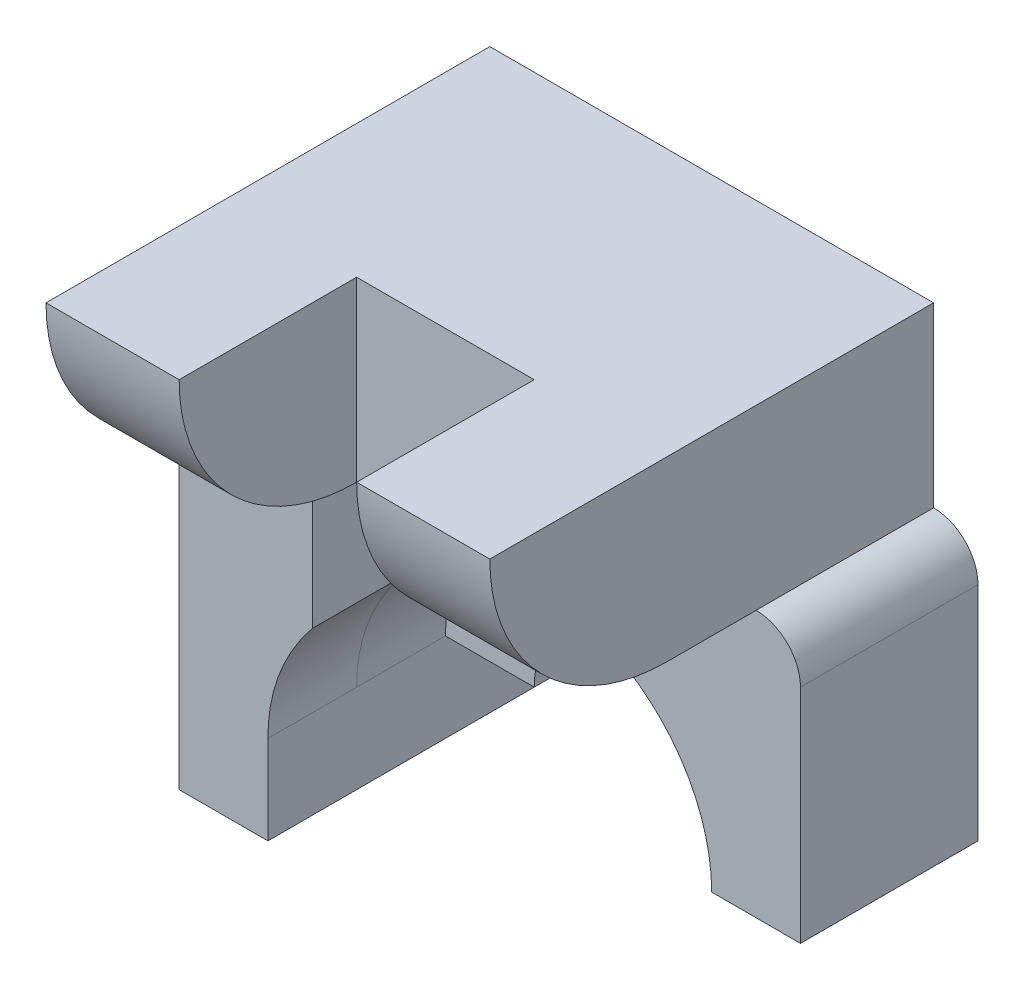
ISO-10303-21;
HEADER;
FILE_DESCRIPTION(('STEP AP214'),'2;1');
FILE_NAME('part.step','',(''),(''),'','','');
FILE_SCHEMA(('AUTOMOTIVE_DESIGN { 1 0 10303 214 1 1 1 1 }'));
ENDSEC;
DATA;
#1=APPLICATION_CONTEXT('core data for automotive mechanical design processes');
#2=APPLICATION_PROTOCOL_DEFINITION('international standard','automotive_design',2000,#1);
#3=PRODUCT_CONTEXT('',#1,'mechanical');
#4=PRODUCT('Part','Part','',(#3));
#5=PRODUCT_RELATED_PRODUCT_CATEGORY('part','',(#4));
#6=PRODUCT_DEFINITION_FORMATION('','',#4);
#7=PRODUCT_DEFINITION_CONTEXT('part definition',#1,'design');
#8=PRODUCT_DEFINITION('design','',#6,#7);
#9=PRODUCT_DEFINITION_SHAPE('','',#8);
#10=(LENGTH_UNIT() NAMED_UNIT(*) SI_UNIT(.MILLI.,.METRE.));
#11=(NAMED_UNIT(*) PLANE_ANGLE_UNIT() SI_UNIT($,.RADIAN.));
#12=(NAMED_UNIT(*) SI_UNIT($,.STERADIAN.) SOLID_ANGLE_UNIT());
#13=UNCERTAINTY_MEASURE_WITH_UNIT(LENGTH_MEASURE(1.E-05),#10,'distance_accuracy_value','');
#14=(GEOMETRIC_REPRESENTATION_CONTEXT(3) GLOBAL_UNCERTAINTY_ASSIGNED_CONTEXT((#13)) GLOBAL_UNIT_ASSIGNED_CONTEXT((#10,
#11,#12)) REPRESENTATION_CONTEXT('',''));
#15=CARTESIAN_POINT('',(0.,0.,0.));
#16=DIRECTION('',(0.,0.,1.));
#17=DIRECTION('',(1.,0.,0.));
#18=AXIS2_PLACEMENT_3D('',#15,#16,#17);
#19=CARTESIAN_POINT('',(-15.,25.,15.));
#20=DIRECTION('',(1.,0.,0.));
#21=DIRECTION('',(0.,1.,0.));
#22=AXIS2_PLACEMENT_3D('',#19,#20,#21);
#23=CYLINDRICAL_SURFACE('',#22,10.);
#24=DIRECTION('',(-1.,0.,0.));
#25=VECTOR('',#24,1.);
#26=CARTESIAN_POINT('',(12.5,25.,25.));
#27=LINE('',#26,#25);
#28=CARTESIAN_POINT('',(12.5,25.,25.));
#29=VERTEX_POINT('',#28);
#30=CARTESIAN_POINT('',(4.99999999999998,25.,25.));
#31=VERTEX_POINT('',#30);
#32=EDGE_CURVE('E202',#29,#31,#27,.T.);
#33=ORIENTED_EDGE('',*,*,#32,.T.);
#34=CARTESIAN_POINT('',(4.99999999999998,25.,15.));
#35=DIRECTION('',(1.,0.,0.));
#36=DIRECTION('',(0.,0.,-1.));
#37=AXIS2_PLACEMENT_3D('',#34,#35,#36);
#38=CIRCLE('',#37,10.);
#39=CARTESIAN_POINT('',(4.99999999999998,15.,15.));
#40=VERTEX_POINT('',#39);
#41=EDGE_CURVE('E11',#31,#40,#38,.T.);
#42=ORIENTED_EDGE('',*,*,#41,.T.);
#43=DIRECTION('',(1.,0.,0.));
#44=VECTOR('',#43,1.);
#45=CARTESIAN_POINT('',(-15.,15.,15.));
#46=LINE('',#45,#44);
#47=CARTESIAN_POINT('',(12.5,15.,15.));
#48=VERTEX_POINT('',#47);
#49=EDGE_CURVE('E194',#40,#48,#46,.T.);
#50=ORIENTED_EDGE('',*,*,#49,.T.);
#51=CARTESIAN_POINT('',(12.5,25.,15.));
#52=DIRECTION('',(-1.,0.,0.));
#53=DIRECTION('',(0.,1.,0.));
#54=AXIS2_PLACEMENT_3D('',#51,#52,#53);
#55=CIRCLE('',#54,10.);
#56=EDGE_CURVE('E191',#48,#29,#55,.T.);
#57=ORIENTED_EDGE('',*,*,#56,.T.);
#58=EDGE_LOOP('',(#33,#42,#50,#57));
#59=FACE_BOUND('',#58,.T.);
#60=ADVANCED_FACE('F35',(#59),#23,.T.);
#61=CARTESIAN_POINT('',(0.,0.,10.));
#62=DIRECTION('',(0.,0.,-1.));
#63=DIRECTION('',(-1.,0.,0.));
#64=AXIS2_PLACEMENT_3D('',#61,#62,#63);
#65=PLANE('',#64);
#66=DIRECTION('',(0.,1.,0.));
#67=VECTOR('',#66,1.);
#68=CARTESIAN_POINT('',(-7.5,15.,10.));
#69=LINE('',#68,#67);
#70=CARTESIAN_POINT('',(-7.5,6.61437827766148,10.));
#71=VERTEX_POINT('',#70);
#72=CARTESIAN_POINT('',(-7.5,15.,10.));
#73=VERTEX_POINT('',#72);
#74=EDGE_CURVE('E58',#71,#73,#69,.T.);
#75=ORIENTED_EDGE('',*,*,#74,.F.);
#76=CARTESIAN_POINT('',(0.,0.,10.));
#77=DIRECTION('',(0.,0.,-1.));
#78=DIRECTION('',(-1.,0.,0.));
#79=AXIS2_PLACEMENT_3D('',#76,#77,#78);
#80=CIRCLE('',#79,10.);
#81=CARTESIAN_POINT('',(10.,0.,10.));
#82=VERTEX_POINT('',#81);
#83=EDGE_CURVE('E380',#71,#82,#80,.T.);
#84=ORIENTED_EDGE('',*,*,#83,.T.);
#85=DIRECTION('',(1.,0.,0.));
#86=VECTOR('',#85,1.);
#87=CARTESIAN_POINT('',(10.,0.,10.));
#88=LINE('',#87,#86);
#89=CARTESIAN_POINT('',(15.,0.,10.));
#90=VERTEX_POINT('',#89);
#91=EDGE_CURVE('E411',#82,#90,#88,.T.);
#92=ORIENTED_EDGE('',*,*,#91,.T.);
#93=DIRECTION('',(0.,1.,0.));
#94=VECTOR('',#93,1.);
#95=CARTESIAN_POINT('',(15.,0.,10.));
#96=LINE('',#95,#94);
#97=CARTESIAN_POINT('',(15.,12.5,10.));
#98=VERTEX_POINT('',#97);
#99=EDGE_CURVE('E410',#90,#98,#96,.T.);
#100=ORIENTED_EDGE('',*,*,#99,.T.);
#101=CARTESIAN_POINT('',(12.5,12.5,10.));
#102=DIRECTION('',(0.,0.,1.));
#103=DIRECTION('',(1.,0.,0.));
#104=AXIS2_PLACEMENT_3D('',#101,#102,#103);
#105=CIRCLE('',#104,2.5);
#106=CARTESIAN_POINT('',(12.5,15.,10.));
#107=VERTEX_POINT('',#106);
#108=EDGE_CURVE('E359',#98,#107,#105,.T.);
#109=ORIENTED_EDGE('',*,*,#108,.T.);
#110=DIRECTION('',(-1.,0.,0.));
#111=VECTOR('',#110,1.);
#112=CARTESIAN_POINT('',(12.5,15.,10.));
#113=LINE('',#112,#111);
#114=EDGE_CURVE('E356',#107,#73,#113,.T.);
#115=ORIENTED_EDGE('',*,*,#114,.T.);
#116=EDGE_LOOP('',(#75,#84,#92,#100,#109,#115));
#117=FACE_BOUND('',#116,.T.);
#118=ADVANCED_FACE('F256',(#117),#65,.F.);
#119=CARTESIAN_POINT('',(0.,0.,10.));
#120=DIRECTION('',(0.,0.,-1.));
#121=DIRECTION('',(-1.,0.,0.));
#122=AXIS2_PLACEMENT_3D('',#119,#120,#121);
#123=CYLINDRICAL_SURFACE('',#122,10.);
#124=DIRECTION('',(0.,0.,-1.));
#125=VECTOR('',#124,1.);
#126=CARTESIAN_POINT('',(-10.,0.,10.));
#127=LINE('',#126,#125);
#128=CARTESIAN_POINT('',(-10.,0.,10.));
#129=VERTEX_POINT('',#128);
#130=CARTESIAN_POINT('',(-10.,0.,5.));
#131=VERTEX_POINT('',#130);
#132=EDGE_CURVE('E358',#129,#131,#127,.T.);
#133=ORIENTED_EDGE('',*,*,#132,.T.);
#134=CARTESIAN_POINT('',(0.,0.,5.));
#135=DIRECTION('',(0.,0.,1.));
#136=DIRECTION('',(1.,0.,0.));
#137=AXIS2_PLACEMENT_3D('',#134,#135,#136);
#138=CIRCLE('',#137,10.);
#139=CARTESIAN_POINT('',(10.,0.,5.));
#140=VERTEX_POINT('',#139);
#141=EDGE_CURVE('E428',#131,#140,#138,.F.);
#142=ORIENTED_EDGE('',*,*,#141,.T.);
#143=DIRECTION('',(0.,0.,-1.));
#144=VECTOR('',#143,1.);
#145=CARTESIAN_POINT('',(10.,0.,10.));
#146=LINE('',#145,#144);
#147=EDGE_CURVE('E344',#82,#140,#146,.T.);
#148=ORIENTED_EDGE('',*,*,#147,.F.);
#149=ORIENTED_EDGE('',*,*,#83,.F.);
#150=EDGE_CURVE('E412',#129,#71,#80,.T.);
#151=ORIENTED_EDGE('',*,*,#150,.F.);
#152=EDGE_LOOP('',(#133,#142,#148,#149,#151));
#153=FACE_BOUND('',#152,.T.);
#154=ADVANCED_FACE('F37',(#153),#123,.F.);
#155=CARTESIAN_POINT('',(10.,0.,10.));
#156=DIRECTION('',(0.,1.,0.));
#157=DIRECTION('',(0.,0.,1.));
#158=AXIS2_PLACEMENT_3D('',#155,#156,#157);
#159=PLANE('',#158);
#160=DIRECTION('',(1.,0.,0.));
#161=VECTOR('',#160,1.);
#162=CARTESIAN_POINT('',(10.,0.,0.));
#163=LINE('',#162,#161);
#164=CARTESIAN_POINT('',(5.,0.,0.));
#165=VERTEX_POINT('',#164);
#166=CARTESIAN_POINT('',(15.,0.,0.));
#167=VERTEX_POINT('',#166);
#168=EDGE_CURVE('E364',#165,#167,#163,.T.);
#169=ORIENTED_EDGE('',*,*,#168,.T.);
#170=DIRECTION('',(0.,0.,-1.));
#171=VECTOR('',#170,1.);
#172=CARTESIAN_POINT('',(15.,0.,10.));
#173=LINE('',#172,#171);
#174=EDGE_CURVE('E346',#90,#167,#173,.T.);
#175=ORIENTED_EDGE('',*,*,#174,.F.);
#176=ORIENTED_EDGE('',*,*,#91,.F.);
#177=ORIENTED_EDGE('',*,*,#147,.T.);
#178=DIRECTION('',(1.,0.,0.));
#179=VECTOR('',#178,1.);
#180=CARTESIAN_POINT('',(0.,0.,5.));
#181=LINE('',#180,#179);
#182=CARTESIAN_POINT('',(5.,0.,5.));
#183=VERTEX_POINT('',#182);
#184=EDGE_CURVE('E424',#183,#140,#181,.T.);
#185=ORIENTED_EDGE('',*,*,#184,.F.);
#186=DIRECTION('',(0.,0.,-1.));
#187=VECTOR('',#186,1.);
#188=CARTESIAN_POINT('',(5.,0.,5.));
#189=LINE('',#188,#187);
#190=EDGE_CURVE('E421',#183,#165,#189,.T.);
#191=ORIENTED_EDGE('',*,*,#190,.T.);
#192=EDGE_LOOP('',(#169,#175,#176,#177,#185,#191));
#193=FACE_BOUND('',#192,.T.);
#194=ADVANCED_FACE('F284',(#193),#159,.F.);
#195=CARTESIAN_POINT('',(15.,0.,10.));
#196=DIRECTION('',(-1.,0.,0.));
#197=DIRECTION('',(0.,0.,1.));
#198=AXIS2_PLACEMENT_3D('',#195,#196,#197);
#199=PLANE('',#198);
#200=DIRECTION('',(0.,1.,0.));
#201=VECTOR('',#200,1.);
#202=CARTESIAN_POINT('',(15.,0.,0.));
#203=LINE('',#202,#201);
#204=CARTESIAN_POINT('',(15.,12.5,0.));
#205=VERTEX_POINT('',#204);
#206=EDGE_CURVE('E366',#167,#205,#203,.T.);
#207=ORIENTED_EDGE('',*,*,#206,.T.);
#208=DIRECTION('',(0.,0.,-1.));
#209=VECTOR('',#208,1.);
#210=CARTESIAN_POINT('',(15.,12.5,10.));
#211=LINE('',#210,#209);
#212=EDGE_CURVE('E353',#98,#205,#211,.T.);
#213=ORIENTED_EDGE('',*,*,#212,.F.);
#214=ORIENTED_EDGE('',*,*,#99,.F.);
#215=ORIENTED_EDGE('',*,*,#174,.T.);
#216=EDGE_LOOP('',(#207,#213,#214,#215));
#217=FACE_BOUND('',#216,.T.);
#218=ADVANCED_FACE('F281',(#217),#199,.F.);
#219=CARTESIAN_POINT('',(12.5,12.5,10.));
#220=DIRECTION('',(0.,0.,-1.));
#221=DIRECTION('',(-1.,0.,0.));
#222=AXIS2_PLACEMENT_3D('',#219,#220,#221);
#223=CYLINDRICAL_SURFACE('',#222,2.5);
#224=CARTESIAN_POINT('',(12.5,12.5,0.));
#225=DIRECTION('',(0.,0.,1.));
#226=DIRECTION('',(1.,0.,0.));
#227=AXIS2_PLACEMENT_3D('',#224,#225,#226);
#228=CIRCLE('',#227,2.5);
#229=CARTESIAN_POINT('',(12.5,15.,0.));
#230=VERTEX_POINT('',#229);
#231=EDGE_CURVE('E369',#205,#230,#228,.T.);
#232=ORIENTED_EDGE('',*,*,#231,.T.);
#233=DIRECTION('',(0.,0.,-1.));
#234=VECTOR('',#233,1.);
#235=CARTESIAN_POINT('',(12.5,15.,10.));
#236=LINE('',#235,#234);
#237=EDGE_CURVE('E395',#107,#230,#236,.T.);
#238=ORIENTED_EDGE('',*,*,#237,.F.);
#239=ORIENTED_EDGE('',*,*,#108,.F.);
#240=ORIENTED_EDGE('',*,*,#212,.T.);
#241=EDGE_LOOP('',(#232,#238,#239,#240));
#242=FACE_BOUND('',#241,.T.);
#243=ADVANCED_FACE('F277',(#242),#223,.T.);
#244=CARTESIAN_POINT('',(-12.5,12.5,10.));
#245=DIRECTION('',(0.,0.,-1.));
#246=DIRECTION('',(-1.,0.,0.));
#247=AXIS2_PLACEMENT_3D('',#244,#245,#246);
#248=CYLINDRICAL_SURFACE('',#247,2.5);
#249=CARTESIAN_POINT('',(-12.5,12.5,0.));
#250=DIRECTION('',(0.,0.,1.));
#251=DIRECTION('',(-1.,0.,0.));
#252=AXIS2_PLACEMENT_3D('',#249,#250,#251);
#253=CIRCLE('',#252,2.5);
#254=CARTESIAN_POINT('',(-12.5,15.,0.));
#255=VERTEX_POINT('',#254);
#256=CARTESIAN_POINT('',(-15.,12.5,0.));
#257=VERTEX_POINT('',#256);
#258=EDGE_CURVE('E372',#255,#257,#253,.T.);
#259=ORIENTED_EDGE('',*,*,#258,.T.);
#260=DIRECTION('',(0.,0.,-1.));
#261=VECTOR('',#260,1.);
#262=CARTESIAN_POINT('',(-15.,12.5,10.));
#263=LINE('',#262,#261);
#264=CARTESIAN_POINT('',(-15.,12.5,15.));
#265=VERTEX_POINT('',#264);
#266=EDGE_CURVE('E389',#265,#257,#263,.T.);
#267=ORIENTED_EDGE('',*,*,#266,.F.);
#268=CARTESIAN_POINT('',(-12.5,12.5,15.));
#269=DIRECTION('',(0.,0.,1.));
#270=DIRECTION('',(1.,0.,0.));
#271=AXIS2_PLACEMENT_3D('',#268,#269,#270);
#272=CIRCLE('',#271,2.5);
#273=CARTESIAN_POINT('',(-12.5,15.,15.));
#274=VERTEX_POINT('',#273);
#275=EDGE_CURVE('E337',#274,#265,#272,.T.);
#276=ORIENTED_EDGE('',*,*,#275,.F.);
#277=DIRECTION('',(0.,0.,-1.));
#278=VECTOR('',#277,1.);
#279=CARTESIAN_POINT('',(-12.5,15.,10.));
#280=LINE('',#279,#278);
#281=EDGE_CURVE('E392',#274,#255,#280,.T.);
#282=ORIENTED_EDGE('',*,*,#281,.T.);
#283=EDGE_LOOP('',(#259,#267,#276,#282));
#284=FACE_BOUND('',#283,.T.);
#285=ADVANCED_FACE('F273',(#284),#248,.T.);
#286=CARTESIAN_POINT('',(-15.,12.5,10.));
#287=DIRECTION('',(1.,0.,0.));
#288=DIRECTION('',(0.,1.,0.));
#289=AXIS2_PLACEMENT_3D('',#286,#287,#288);
#290=PLANE('',#289);
#291=DIRECTION('',(0.,-1.,0.));
#292=VECTOR('',#291,1.);
#293=CARTESIAN_POINT('',(-15.,12.5,0.));
#294=LINE('',#293,#292);
#295=CARTESIAN_POINT('',(-15.,-5.,0.));
#296=VERTEX_POINT('',#295);
#297=EDGE_CURVE('E374',#257,#296,#294,.T.);
#298=ORIENTED_EDGE('',*,*,#297,.T.);
#299=DIRECTION('',(0.,0.,-1.));
#300=VECTOR('',#299,1.);
#301=CARTESIAN_POINT('',(-15.,-5.,10.));
#302=LINE('',#301,#300);
#303=CARTESIAN_POINT('',(-15.,-5.,15.));
#304=VERTEX_POINT('',#303);
#305=EDGE_CURVE('E386',#304,#296,#302,.T.);
#306=ORIENTED_EDGE('',*,*,#305,.F.);
#307=DIRECTION('',(0.,-1.,0.));
#308=VECTOR('',#307,1.);
#309=CARTESIAN_POINT('',(-15.,12.5,15.));
#310=LINE('',#309,#308);
#311=EDGE_CURVE('E332',#265,#304,#310,.T.);
#312=ORIENTED_EDGE('',*,*,#311,.F.);
#313=ORIENTED_EDGE('',*,*,#266,.T.);
#314=EDGE_LOOP('',(#298,#306,#312,#313));
#315=FACE_BOUND('',#314,.T.);
#316=ADVANCED_FACE('F269',(#315),#290,.F.);
#317=CARTESIAN_POINT('',(-15.,-5.,10.));
#318=DIRECTION('',(0.,1.,0.));
#319=DIRECTION('',(0.,0.,1.));
#320=AXIS2_PLACEMENT_3D('',#317,#318,#319);
#321=PLANE('',#320);
#322=DIRECTION('',(1.,0.,0.));
#323=VECTOR('',#322,1.);
#324=CARTESIAN_POINT('',(-15.,-5.,0.));
#325=LINE('',#324,#323);
#326=CARTESIAN_POINT('',(-10.,-5.,0.));
#327=VERTEX_POINT('',#326);
#328=EDGE_CURVE('E376',#296,#327,#325,.T.);
#329=ORIENTED_EDGE('',*,*,#328,.T.);
#330=DIRECTION('',(0.,0.,-1.));
#331=VECTOR('',#330,1.);
#332=CARTESIAN_POINT('',(-10.,-5.,10.));
#333=LINE('',#332,#331);
#334=CARTESIAN_POINT('',(-10.,-5.,15.));
#335=VERTEX_POINT('',#334);
#336=EDGE_CURVE('E383',#335,#327,#333,.T.);
#337=ORIENTED_EDGE('',*,*,#336,.F.);
#338=DIRECTION('',(1.,0.,0.));
#339=VECTOR('',#338,1.);
#340=CARTESIAN_POINT('',(-15.,-5.,15.));
#341=LINE('',#340,#339);
#342=EDGE_CURVE('E220',#304,#335,#341,.T.);
#343=ORIENTED_EDGE('',*,*,#342,.F.);
#344=ORIENTED_EDGE('',*,*,#305,.T.);
#345=EDGE_LOOP('',(#329,#337,#343,#344));
#346=FACE_BOUND('',#345,.T.);
#347=ADVANCED_FACE('F265',(#346),#321,.F.);
#348=CARTESIAN_POINT('',(-10.,-5.,10.));
#349=DIRECTION('',(-1.,0.,0.));
#350=DIRECTION('',(0.,0.,1.));
#351=AXIS2_PLACEMENT_3D('',#348,#349,#350);
#352=PLANE('',#351);
#353=DIRECTION('',(0.,1.,0.));
#354=VECTOR('',#353,1.);
#355=CARTESIAN_POINT('',(-10.,-5.,0.));
#356=LINE('',#355,#354);
#357=CARTESIAN_POINT('',(-10.,0.,0.));
#358=VERTEX_POINT('',#357);
#359=EDGE_CURVE('E378',#327,#358,#356,.T.);
#360=ORIENTED_EDGE('',*,*,#359,.T.);
#361=DIRECTION('',(0.,0.,-1.));
#362=VECTOR('',#361,1.);
#363=CARTESIAN_POINT('',(-10.,0.,5.));
#364=LINE('',#363,#362);
#365=EDGE_CURVE('E367',#131,#358,#364,.T.);
#366=ORIENTED_EDGE('',*,*,#365,.F.);
#367=ORIENTED_EDGE('',*,*,#132,.F.);
#368=DIRECTION('',(0.,0.,-1.));
#369=VECTOR('',#368,1.);
#370=CARTESIAN_POINT('',(-10.,0.,15.));
#371=LINE('',#370,#369);
#372=CARTESIAN_POINT('',(-10.,0.,15.));
#373=VERTEX_POINT('',#372);
#374=EDGE_CURVE('E334',#373,#129,#371,.T.);
#375=ORIENTED_EDGE('',*,*,#374,.F.);
#376=DIRECTION('',(0.,1.,0.));
#377=VECTOR('',#376,1.);
#378=CARTESIAN_POINT('',(-10.,-5.,15.));
#379=LINE('',#378,#377);
#380=EDGE_CURVE('E223',#335,#373,#379,.T.);
#381=ORIENTED_EDGE('',*,*,#380,.F.);
#382=ORIENTED_EDGE('',*,*,#336,.T.);
#383=EDGE_LOOP('',(#360,#366,#367,#375,#381,#382));
#384=FACE_BOUND('',#383,.T.);
#385=ADVANCED_FACE('F261',(#384),#352,.F.);
#386=CARTESIAN_POINT('',(0.,0.,0.));
#387=DIRECTION('',(0.,0.,-1.));
#388=DIRECTION('',(-1.,0.,0.));
#389=AXIS2_PLACEMENT_3D('',#386,#387,#388);
#390=PLANE('',#389);
#391=ORIENTED_EDGE('',*,*,#168,.F.);
#392=CARTESIAN_POINT('',(0.,0.,0.));
#393=DIRECTION('',(0.,0.,1.));
#394=DIRECTION('',(1.,0.,0.));
#395=AXIS2_PLACEMENT_3D('',#392,#393,#394);
#396=CIRCLE('',#395,5.);
#397=CARTESIAN_POINT('',(-5.,0.,0.));
#398=VERTEX_POINT('',#397);
#399=EDGE_CURVE('E425',#165,#398,#396,.T.);
#400=ORIENTED_EDGE('',*,*,#399,.T.);
#401=DIRECTION('',(-1.,0.,0.));
#402=VECTOR('',#401,1.);
#403=CARTESIAN_POINT('',(0.,0.,0.));
#404=LINE('',#403,#402);
#405=EDGE_CURVE('E429',#398,#358,#404,.T.);
#406=ORIENTED_EDGE('',*,*,#405,.T.);
#407=ORIENTED_EDGE('',*,*,#359,.F.);
#408=ORIENTED_EDGE('',*,*,#328,.F.);
#409=ORIENTED_EDGE('',*,*,#297,.F.);
#410=ORIENTED_EDGE('',*,*,#258,.F.);
#411=DIRECTION('',(0.,-1.,0.));
#412=VECTOR('',#411,1.);
#413=CARTESIAN_POINT('',(-12.5,15.,0.));
#414=LINE('',#413,#412);
#415=CARTESIAN_POINT('',(-12.5,25.,0.));
#416=VERTEX_POINT('',#415);
#417=EDGE_CURVE('E210',#416,#255,#414,.T.);
#418=ORIENTED_EDGE('',*,*,#417,.F.);
#419=DIRECTION('',(-1.,0.,0.));
#420=VECTOR('',#419,1.);
#421=CARTESIAN_POINT('',(12.5,25.,0.));
#422=LINE('',#421,#420);
#423=CARTESIAN_POINT('',(12.5,25.,0.));
#424=VERTEX_POINT('',#423);
#425=EDGE_CURVE('E208',#424,#416,#422,.T.);
#426=ORIENTED_EDGE('',*,*,#425,.F.);
#427=DIRECTION('',(0.,1.,0.));
#428=VECTOR('',#427,1.);
#429=CARTESIAN_POINT('',(12.5,15.,0.));
#430=LINE('',#429,#428);
#431=EDGE_CURVE('E201',#230,#424,#430,.T.);
#432=ORIENTED_EDGE('',*,*,#431,.F.);
#433=ORIENTED_EDGE('',*,*,#231,.F.);
#434=ORIENTED_EDGE('',*,*,#206,.F.);
#435=EDGE_LOOP('',(#391,#400,#406,#407,#408,#409,#410,#418,#426,#432,#433,#434));
#436=FACE_BOUND('',#435,.T.);
#437=ADVANCED_FACE('F254',(#436),#390,.T.);
#438=CARTESIAN_POINT('',(0.,0.,5.));
#439=DIRECTION('',(0.,-1.,0.));
#440=DIRECTION('',(1.,0.,0.));
#441=AXIS2_PLACEMENT_3D('',#438,#439,#440);
#442=PLANE('',#441);
#443=ORIENTED_EDGE('',*,*,#405,.F.);
#444=DIRECTION('',(0.,0.,-1.));
#445=VECTOR('',#444,1.);
#446=CARTESIAN_POINT('',(-5.,0.,5.));
#447=LINE('',#446,#445);
#448=CARTESIAN_POINT('',(-5.,0.,5.));
#449=VERTEX_POINT('',#448);
#450=EDGE_CURVE('E419',#449,#398,#447,.T.);
#451=ORIENTED_EDGE('',*,*,#450,.F.);
#452=DIRECTION('',(-1.,0.,0.));
#453=VECTOR('',#452,1.);
#454=CARTESIAN_POINT('',(0.,0.,5.));
#455=LINE('',#454,#453);
#456=EDGE_CURVE('E436',#449,#131,#455,.T.);
#457=ORIENTED_EDGE('',*,*,#456,.T.);
#458=ORIENTED_EDGE('',*,*,#365,.T.);
#459=EDGE_LOOP('',(#443,#451,#457,#458));
#460=FACE_BOUND('',#459,.T.);
#461=ADVANCED_FACE('F250',(#460),#442,.T.);
#462=CARTESIAN_POINT('',(0.,0.,5.));
#463=DIRECTION('',(0.,0.,-1.));
#464=DIRECTION('',(-1.,0.,0.));
#465=AXIS2_PLACEMENT_3D('',#462,#463,#464);
#466=CYLINDRICAL_SURFACE('',#465,5.);
#467=ORIENTED_EDGE('',*,*,#399,.F.);
#468=ORIENTED_EDGE('',*,*,#190,.F.);
#469=CARTESIAN_POINT('',(0.,0.,5.));
#470=DIRECTION('',(0.,0.,1.));
#471=DIRECTION('',(1.,0.,0.));
#472=AXIS2_PLACEMENT_3D('',#469,#470,#471);
#473=CIRCLE('',#472,5.);
#474=EDGE_CURVE('E433',#183,#449,#473,.T.);
#475=ORIENTED_EDGE('',*,*,#474,.T.);
#476=ORIENTED_EDGE('',*,*,#450,.T.);
#477=EDGE_LOOP('',(#467,#468,#475,#476));
#478=FACE_BOUND('',#477,.T.);
#479=ADVANCED_FACE('F246',(#478),#466,.F.);
#480=CARTESIAN_POINT('',(0.,0.,5.));
#481=DIRECTION('',(0.,0.,1.));
#482=DIRECTION('',(1.,0.,0.));
#483=AXIS2_PLACEMENT_3D('',#480,#481,#482);
#484=PLANE('',#483);
#485=ORIENTED_EDGE('',*,*,#141,.F.);
#486=ORIENTED_EDGE('',*,*,#456,.F.);
#487=ORIENTED_EDGE('',*,*,#474,.F.);
#488=ORIENTED_EDGE('',*,*,#184,.T.);
#489=EDGE_LOOP('',(#485,#486,#487,#488));
#490=FACE_BOUND('',#489,.T.);
#491=ADVANCED_FACE('F241',(#490),#484,.T.);
#492=CARTESIAN_POINT('',(-10.,0.,15.));
#493=CARTESIAN_POINT('',(-10.,3.53553390593274,15.));
#494=CARTESIAN_POINT('',(-7.5,6.61437827766148,15.));
#495=B_SPLINE_CURVE_WITH_KNOTS('',2,(#492,#493,#494),.UNSPECIFIED.,.F.,.F.,(3,3),(0.,1.),.UNSPECIFIED.);
#496=DIRECTION('',(0.,0.,-1.));
#497=VECTOR('',#496,1.);
#498=SURFACE_OF_LINEAR_EXTRUSION('',#495,#497);
#499=CARTESIAN_POINT('',(-10.,0.,10.));
#500=CARTESIAN_POINT('',(-10.,3.53553390593274,10.));
#501=CARTESIAN_POINT('',(-7.5,6.61437827766148,10.));
#502=B_SPLINE_CURVE_WITH_KNOTS('',2,(#499,#500,#501),.UNSPECIFIED.,.F.,.F.,(3,3),(0.,1.),.UNSPECIFIED.);
#503=EDGE_CURVE('E219',#129,#71,#502,.T.);
#504=ORIENTED_EDGE('',*,*,#503,.T.);
#505=DIRECTION('',(0.,0.,-1.));
#506=VECTOR('',#505,1.);
#507=CARTESIAN_POINT('',(-7.5,6.61437827766148,15.));
#508=LINE('',#507,#506);
#509=CARTESIAN_POINT('',(-7.5,6.61437827766148,15.));
#510=VERTEX_POINT('',#509);
#511=EDGE_CURVE('E331',#510,#71,#508,.T.);
#512=ORIENTED_EDGE('',*,*,#511,.F.);
#513=EDGE_CURVE('E225',#373,#510,#495,.T.);
#514=ORIENTED_EDGE('',*,*,#513,.F.);
#515=ORIENTED_EDGE('',*,*,#374,.T.);
#516=EDGE_LOOP('',(#504,#512,#514,#515));
#517=FACE_BOUND('',#516,.T.);
#518=ADVANCED_FACE('F236',(#517),#498,.F.);
#519=CARTESIAN_POINT('',(-7.5,15.,15.));
#520=DIRECTION('',(-1.,0.,0.));
#521=DIRECTION('',(0.,-1.,0.));
#522=AXIS2_PLACEMENT_3D('',#519,#520,#521);
#523=PLANE('',#522);
#524=ORIENTED_EDGE('',*,*,#74,.T.);
#525=DIRECTION('',(0.,0.,-1.));
#526=VECTOR('',#525,1.);
#527=CARTESIAN_POINT('',(-7.5,15.,15.));
#528=LINE('',#527,#526);
#529=CARTESIAN_POINT('',(-7.5,15.,15.));
#530=VERTEX_POINT('',#529);
#531=EDGE_CURVE('E320',#530,#73,#528,.T.);
#532=ORIENTED_EDGE('',*,*,#531,.F.);
#533=DIRECTION('',(0.,1.,0.));
#534=VECTOR('',#533,1.);
#535=CARTESIAN_POINT('',(-7.5,15.,15.));
#536=LINE('',#535,#534);
#537=EDGE_CURVE('E230',#510,#530,#536,.T.);
#538=ORIENTED_EDGE('',*,*,#537,.F.);
#539=ORIENTED_EDGE('',*,*,#511,.T.);
#540=EDGE_LOOP('',(#524,#532,#538,#539));
#541=FACE_BOUND('',#540,.T.);
#542=ADVANCED_FACE('F240',(#541),#523,.F.);
#543=CARTESIAN_POINT('',(-9.375,3.42136152238174,15.));
#544=DIRECTION('',(0.,0.,-1.));
#545=DIRECTION('',(-1.,0.,0.));
#546=AXIS2_PLACEMENT_3D('',#543,#544,#545);
#547=PLANE('',#546);
#548=ORIENTED_EDGE('',*,*,#342,.T.);
#549=ORIENTED_EDGE('',*,*,#380,.T.);
#550=ORIENTED_EDGE('',*,*,#513,.T.);
#551=ORIENTED_EDGE('',*,*,#537,.T.);
#552=DIRECTION('',(-1.,0.,0.));
#553=VECTOR('',#552,1.);
#554=CARTESIAN_POINT('',(-12.5,15.,15.));
#555=LINE('',#554,#553);
#556=EDGE_CURVE('E313',#530,#274,#555,.T.);
#557=ORIENTED_EDGE('',*,*,#556,.T.);
#558=ORIENTED_EDGE('',*,*,#275,.T.);
#559=ORIENTED_EDGE('',*,*,#311,.T.);
#560=EDGE_LOOP('',(#548,#549,#550,#551,#557,#558,#559));
#561=FACE_BOUND('',#560,.T.);
#562=ADVANCED_FACE('F324',(#561),#547,.F.);
#563=CARTESIAN_POINT('',(-9.375,3.42136152238174,10.));
#564=DIRECTION('',(0.,0.,-1.));
#565=DIRECTION('',(-1.,0.,0.));
#566=AXIS2_PLACEMENT_3D('',#563,#564,#565);
#567=PLANE('',#566);
#568=ORIENTED_EDGE('',*,*,#503,.F.);
#569=ORIENTED_EDGE('',*,*,#150,.T.);
#570=EDGE_LOOP('',(#568,#569));
#571=FACE_BOUND('',#570,.T.);
#572=ADVANCED_FACE('F467',(#571),#567,.T.);
#573=CARTESIAN_POINT('',(12.5,15.,25.));
#574=DIRECTION('',(0.,1.,0.));
#575=DIRECTION('',(0.,0.,1.));
#576=AXIS2_PLACEMENT_3D('',#573,#574,#575);
#577=PLANE('',#576);
#578=DIRECTION('',(0.,0.,-1.));
#579=VECTOR('',#578,1.);
#580=CARTESIAN_POINT('',(12.5,15.,25.));
#581=LINE('',#580,#579);
#582=EDGE_CURVE('E204',#48,#107,#581,.T.);
#583=ORIENTED_EDGE('',*,*,#582,.F.);
#584=ORIENTED_EDGE('',*,*,#49,.F.);
#585=CARTESIAN_POINT('',(-5.00000000000002,15.,15.));
#586=VERTEX_POINT('',#585);
#587=EDGE_CURVE('E175',#586,#40,#46,.T.);
#588=ORIENTED_EDGE('',*,*,#587,.F.);
#589=EDGE_CURVE('E195',#530,#586,#46,.T.);
#590=ORIENTED_EDGE('',*,*,#589,.F.);
#591=ORIENTED_EDGE('',*,*,#531,.T.);
#592=ORIENTED_EDGE('',*,*,#114,.F.);
#593=EDGE_LOOP('',(#583,#584,#588,#590,#591,#592));
#594=FACE_BOUND('',#593,.T.);
#595=ADVANCED_FACE('F317',(#594),#577,.F.);
#596=CARTESIAN_POINT('',(12.5,15.,25.));
#597=DIRECTION('',(-1.,0.,0.));
#598=DIRECTION('',(0.,-1.,0.));
#599=AXIS2_PLACEMENT_3D('',#596,#597,#598);
#600=PLANE('',#599);
#601=DIRECTION('',(0.,0.,-1.));
#602=VECTOR('',#601,1.);
#603=CARTESIAN_POINT('',(12.5,25.,25.));
#604=LINE('',#603,#602);
#605=EDGE_CURVE('E216',#29,#424,#604,.T.);
#606=ORIENTED_EDGE('',*,*,#605,.F.);
#607=ORIENTED_EDGE('',*,*,#56,.F.);
#608=ORIENTED_EDGE('',*,*,#582,.T.);
#609=ORIENTED_EDGE('',*,*,#237,.T.);
#610=ORIENTED_EDGE('',*,*,#431,.T.);
#611=EDGE_LOOP('',(#606,#607,#608,#609,#610));
#612=FACE_BOUND('',#611,.T.);
#613=ADVANCED_FACE('F408',(#612),#600,.F.);
#614=CARTESIAN_POINT('',(12.5,25.,25.));
#615=DIRECTION('',(0.,-1.,0.));
#616=DIRECTION('',(0.,0.,-1.));
#617=AXIS2_PLACEMENT_3D('',#614,#615,#616);
#618=PLANE('',#617);
#619=DIRECTION('',(-1.,0.,0.));
#620=VECTOR('',#619,1.);
#621=CARTESIAN_POINT('',(4.99999999999998,25.,15.));
#622=LINE('',#621,#620);
#623=CARTESIAN_POINT('',(4.99999999999998,25.,15.));
#624=VERTEX_POINT('',#623);
#625=CARTESIAN_POINT('',(-5.00000000000002,25.,15.));
#626=VERTEX_POINT('',#625);
#627=EDGE_CURVE('E172',#624,#626,#622,.T.);
#628=ORIENTED_EDGE('',*,*,#627,.F.);
#629=DIRECTION('',(0.,0.,-1.));
#630=VECTOR('',#629,1.);
#631=CARTESIAN_POINT('',(4.99999999999998,25.,25.));
#632=LINE('',#631,#630);
#633=EDGE_CURVE('E180',#31,#624,#632,.T.);
#634=ORIENTED_EDGE('',*,*,#633,.F.);
#635=ORIENTED_EDGE('',*,*,#32,.F.);
#636=ORIENTED_EDGE('',*,*,#605,.T.);
#637=ORIENTED_EDGE('',*,*,#425,.T.);
#638=DIRECTION('',(0.,0.,-1.));
#639=VECTOR('',#638,1.);
#640=CARTESIAN_POINT('',(-12.5,25.,25.));
#641=LINE('',#640,#639);
#642=CARTESIAN_POINT('',(-12.5,25.,25.));
#643=VERTEX_POINT('',#642);
#644=EDGE_CURVE('E213',#643,#416,#641,.T.);
#645=ORIENTED_EDGE('',*,*,#644,.F.);
#646=CARTESIAN_POINT('',(-5.00000000000002,25.,25.));
#647=VERTEX_POINT('',#646);
#648=EDGE_CURVE('E205',#647,#643,#27,.T.);
#649=ORIENTED_EDGE('',*,*,#648,.F.);
#650=DIRECTION('',(0.,0.,1.));
#651=VECTOR('',#650,1.);
#652=CARTESIAN_POINT('',(-5.00000000000002,25.,25.));
#653=LINE('',#652,#651);
#654=EDGE_CURVE('E177',#626,#647,#653,.T.);
#655=ORIENTED_EDGE('',*,*,#654,.F.);
#656=EDGE_LOOP('',(#628,#634,#635,#636,#637,#645,#649,#655));
#657=FACE_BOUND('',#656,.T.);
#658=ADVANCED_FACE('F186',(#657),#618,.F.);
#659=CARTESIAN_POINT('',(-12.5,15.,25.));
#660=DIRECTION('',(1.,0.,0.));
#661=DIRECTION('',(0.,1.,0.));
#662=AXIS2_PLACEMENT_3D('',#659,#660,#661);
#663=PLANE('',#662);
#664=ORIENTED_EDGE('',*,*,#281,.F.);
#665=CARTESIAN_POINT('',(-12.5,25.,15.));
#666=DIRECTION('',(1.,0.,0.));
#667=DIRECTION('',(0.,1.,0.));
#668=AXIS2_PLACEMENT_3D('',#665,#666,#667);
#669=CIRCLE('',#668,10.);
#670=EDGE_CURVE('E198',#274,#643,#669,.F.);
#671=ORIENTED_EDGE('',*,*,#670,.T.);
#672=ORIENTED_EDGE('',*,*,#644,.T.);
#673=ORIENTED_EDGE('',*,*,#417,.T.);
#674=EDGE_LOOP('',(#664,#671,#672,#673));
#675=FACE_BOUND('',#674,.T.);
#676=ADVANCED_FACE('F301',(#675),#663,.F.);
#677=ORIENTED_EDGE('',*,*,#589,.T.);
#678=CARTESIAN_POINT('',(-5.00000000000002,25.,15.));
#679=DIRECTION('',(-1.,0.,0.));
#680=DIRECTION('',(0.,0.,1.));
#681=AXIS2_PLACEMENT_3D('',#678,#679,#680);
#682=CIRCLE('',#681,10.);
#683=EDGE_CURVE('E43',#586,#647,#682,.T.);
#684=ORIENTED_EDGE('',*,*,#683,.T.);
#685=ORIENTED_EDGE('',*,*,#648,.T.);
#686=ORIENTED_EDGE('',*,*,#670,.F.);
#687=ORIENTED_EDGE('',*,*,#556,.F.);
#688=EDGE_LOOP('',(#677,#684,#685,#686,#687));
#689=FACE_BOUND('',#688,.T.);
#690=ADVANCED_FACE('F295',(#689),#23,.T.);
#691=CARTESIAN_POINT('',(4.99999999999998,0.,25.));
#692=DIRECTION('',(1.,0.,0.));
#693=DIRECTION('',(0.,0.,-1.));
#694=AXIS2_PLACEMENT_3D('',#691,#692,#693);
#695=PLANE('',#694);
#696=ORIENTED_EDGE('',*,*,#633,.T.);
#697=DIRECTION('',(0.,1.,0.));
#698=VECTOR('',#697,1.);
#699=CARTESIAN_POINT('',(4.99999999999998,0.,15.));
#700=LINE('',#699,#698);
#701=EDGE_CURVE('E168',#40,#624,#700,.T.);
#702=ORIENTED_EDGE('',*,*,#701,.F.);
#703=ORIENTED_EDGE('',*,*,#41,.F.);
#704=EDGE_LOOP('',(#696,#702,#703));
#705=FACE_BOUND('',#704,.T.);
#706=ADVANCED_FACE('F181',(#705),#695,.F.);
#707=CARTESIAN_POINT('',(-5.00000000000002,0.,25.));
#708=DIRECTION('',(-1.,0.,0.));
#709=DIRECTION('',(0.,0.,1.));
#710=AXIS2_PLACEMENT_3D('',#707,#708,#709);
#711=PLANE('',#710);
#712=DIRECTION('',(0.,1.,0.));
#713=VECTOR('',#712,1.);
#714=CARTESIAN_POINT('',(-5.00000000000002,0.,15.));
#715=LINE('',#714,#713);
#716=EDGE_CURVE('E50',#586,#626,#715,.T.);
#717=ORIENTED_EDGE('',*,*,#716,.T.);
#718=ORIENTED_EDGE('',*,*,#654,.T.);
#719=ORIENTED_EDGE('',*,*,#683,.F.);
#720=EDGE_LOOP('',(#717,#718,#719));
#721=FACE_BOUND('',#720,.T.);
#722=ADVANCED_FACE('F307',(#721),#711,.F.);
#723=CARTESIAN_POINT('',(4.99999999999998,0.,15.));
#724=DIRECTION('',(0.,0.,-1.));
#725=DIRECTION('',(-1.,0.,0.));
#726=AXIS2_PLACEMENT_3D('',#723,#724,#725);
#727=PLANE('',#726);
#728=ORIENTED_EDGE('',*,*,#701,.T.);
#729=ORIENTED_EDGE('',*,*,#627,.T.);
#730=ORIENTED_EDGE('',*,*,#716,.F.);
#731=ORIENTED_EDGE('',*,*,#587,.T.);
#732=EDGE_LOOP('',(#728,#729,#730,#731));
#733=FACE_BOUND('',#732,.T.);
#734=ADVANCED_FACE('F170',(#733),#727,.F.);
#735=CLOSED_SHELL('',(#60,#118,#154,#194,#218,#243,#285,#316,#347,#385,#437,#461,#479,#491,#518,
#542,#562,#572,#595,#613,#658,#676,#690,#706,#722,#734));
#736=MANIFOLD_SOLID_BREP('B2',#735);
#737=ADVANCED_BREP_SHAPE_REPRESENTATION('',(#18,#736),#14);
#738=SHAPE_DEFINITION_REPRESENTATION(#9,#737);
ENDSEC;
END-ISO-10303-21;
